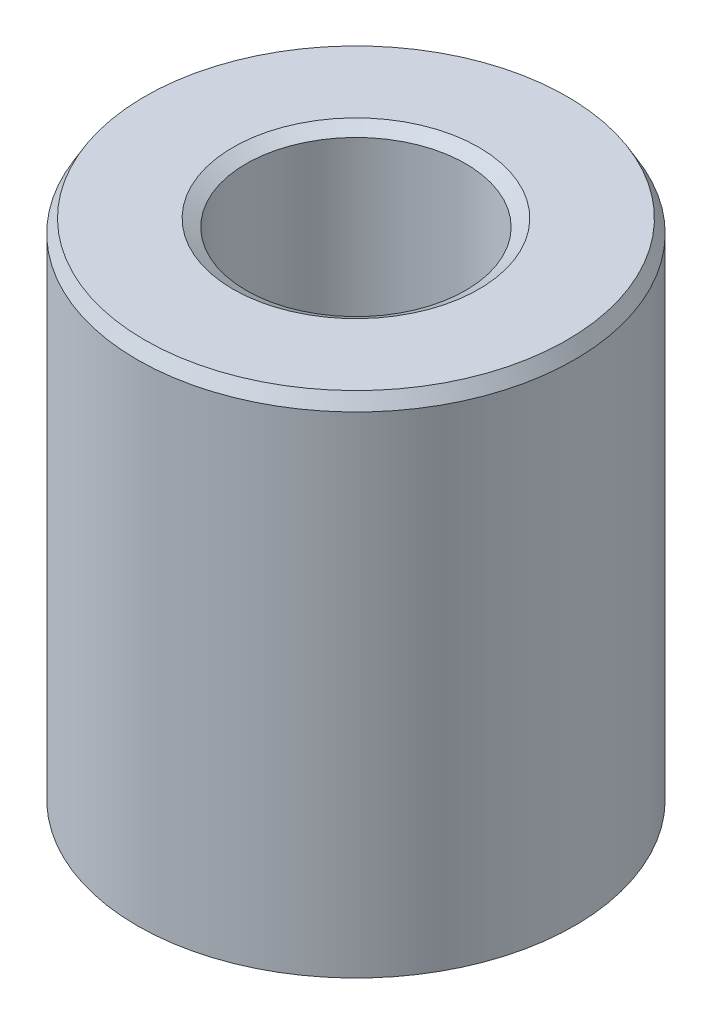
ISO-10303-21;
HEADER;
FILE_DESCRIPTION(('STEP AP214'),'2;1');
FILE_NAME('part.step','',(''),(''),'','','');
FILE_SCHEMA(('AUTOMOTIVE_DESIGN { 1 0 10303 214 1 1 1 1 }'));
ENDSEC;
DATA;
#1=APPLICATION_CONTEXT('core data for automotive mechanical design processes');
#2=APPLICATION_PROTOCOL_DEFINITION('international standard','automotive_design',2000,#1);
#3=PRODUCT_CONTEXT('',#1,'mechanical');
#4=PRODUCT('Part','Part','',(#3));
#5=PRODUCT_RELATED_PRODUCT_CATEGORY('part','',(#4));
#6=PRODUCT_DEFINITION_FORMATION('','',#4);
#7=PRODUCT_DEFINITION_CONTEXT('part definition',#1,'design');
#8=PRODUCT_DEFINITION('design','',#6,#7);
#9=PRODUCT_DEFINITION_SHAPE('','',#8);
#10=(LENGTH_UNIT() NAMED_UNIT(*) SI_UNIT(.MILLI.,.METRE.));
#11=(NAMED_UNIT(*) PLANE_ANGLE_UNIT() SI_UNIT($,.RADIAN.));
#12=(NAMED_UNIT(*) SI_UNIT($,.STERADIAN.) SOLID_ANGLE_UNIT());
#13=UNCERTAINTY_MEASURE_WITH_UNIT(LENGTH_MEASURE(1.E-05),#10,'distance_accuracy_value','');
#14=(GEOMETRIC_REPRESENTATION_CONTEXT(3) GLOBAL_UNCERTAINTY_ASSIGNED_CONTEXT((#13)) GLOBAL_UNIT_ASSIGNED_CONTEXT((#10,
#11,#12)) REPRESENTATION_CONTEXT('',''));
#15=CARTESIAN_POINT('',(0.,0.,0.));
#16=DIRECTION('',(0.,0.,1.));
#17=DIRECTION('',(1.,0.,0.));
#18=AXIS2_PLACEMENT_3D('',#15,#16,#17);
#19=CARTESIAN_POINT('',(0.,105.158621995185,0.));
#20=DIRECTION('',(0.,-1.,0.));
#21=DIRECTION('',(0.,0.,-1.));
#22=AXIS2_PLACEMENT_3D('',#19,#20,#21);
#23=CYLINDRICAL_SURFACE('',#22,45.);
#24=CARTESIAN_POINT('',(0.,1.56636908599792,0.));
#25=DIRECTION('',(0.,1.,0.));
#26=DIRECTION('',(0.,0.,1.));
#27=AXIS2_PLACEMENT_3D('',#24,#25,#26);
#28=CIRCLE('',#27,45.);
#29=CARTESIAN_POINT('',(0.,1.56636908599792,45.));
#30=VERTEX_POINT('',#29);
#31=EDGE_CURVE('E10',#30,#30,#28,.T.);
#32=ORIENTED_EDGE('',*,*,#31,.T.);
#33=EDGE_LOOP('',(#32));
#34=FACE_BOUND('',#33,.T.);
#35=CARTESIAN_POINT('',(0.,102.445591154832,0.));
#36=DIRECTION('',(0.,1.,0.));
#37=DIRECTION('',(0.,0.,1.));
#38=AXIS2_PLACEMENT_3D('',#35,#36,#37);
#39=CIRCLE('',#38,45.);
#40=CARTESIAN_POINT('',(0.,102.445591154832,45.));
#41=VERTEX_POINT('',#40);
#42=EDGE_CURVE('E50',#41,#41,#39,.F.);
#43=ORIENTED_EDGE('',*,*,#42,.T.);
#44=EDGE_LOOP('',(#43));
#45=FACE_BOUND('',#44,.T.);
#46=ADVANCED_FACE('F39',(#34,#45),#23,.T.);
#47=CARTESIAN_POINT('',(0.,105.158621995185,0.));
#48=DIRECTION('',(0.,1.,0.));
#49=DIRECTION('',(0.,0.,1.));
#50=AXIS2_PLACEMENT_3D('',#47,#48,#49);
#51=PLANE('',#50);
#52=CARTESIAN_POINT('',(0.,105.158621995185,0.));
#53=DIRECTION('',(0.,1.,0.));
#54=DIRECTION('',(0.,0.,1.));
#55=AXIS2_PLACEMENT_3D('',#52,#53,#54);
#56=CIRCLE('',#55,25.3015592322907);
#57=CARTESIAN_POINT('',(0.,105.158621995185,25.3015592322907));
#58=VERTEX_POINT('',#57);
#59=EDGE_CURVE('E58',#58,#58,#56,.F.);
#60=ORIENTED_EDGE('',*,*,#59,.T.);
#61=EDGE_LOOP('',(#60));
#62=FACE_BOUND('',#61,.T.);
#63=CARTESIAN_POINT('',(0.,105.158621995185,0.));
#64=DIRECTION('',(0.,1.,0.));
#65=DIRECTION('',(0.,0.,1.));
#66=AXIS2_PLACEMENT_3D('',#63,#64,#65);
#67=CIRCLE('',#66,43.4336309140022);
#68=CARTESIAN_POINT('',(0.,105.158621995185,43.4336309140022));
#69=VERTEX_POINT('',#68);
#70=EDGE_CURVE('E61',#69,#69,#67,.T.);
#71=ORIENTED_EDGE('',*,*,#70,.T.);
#72=EDGE_LOOP('',(#71));
#73=FACE_BOUND('',#72,.T.);
#74=ADVANCED_FACE('F88',(#62,#73),#51,.T.);
#75=CARTESIAN_POINT('',(0.,0.,0.));
#76=DIRECTION('',(0.,1.,0.));
#77=DIRECTION('',(0.,0.,1.));
#78=AXIS2_PLACEMENT_3D('',#75,#76,#77);
#79=PLANE('',#78);
#80=CARTESIAN_POINT('',(0.,0.,0.));
#81=DIRECTION('',(0.,1.,0.));
#82=DIRECTION('',(0.,0.,1.));
#83=AXIS2_PLACEMENT_3D('',#80,#81,#82);
#84=CIRCLE('',#83,24.154897477935);
#85=CARTESIAN_POINT('',(0.,0.,24.154897477935));
#86=VERTEX_POINT('',#85);
#87=EDGE_CURVE('E51',#86,#86,#84,.T.);
#88=ORIENTED_EDGE('',*,*,#87,.T.);
#89=EDGE_LOOP('',(#88));
#90=FACE_BOUND('',#89,.T.);
#91=CARTESIAN_POINT('',(0.,0.,0.));
#92=DIRECTION('',(0.,1.,0.));
#93=DIRECTION('',(0.,0.,1.));
#94=AXIS2_PLACEMENT_3D('',#91,#92,#93);
#95=CIRCLE('',#94,42.2869691596464);
#96=CARTESIAN_POINT('',(0.,0.,42.2869691596464));
#97=VERTEX_POINT('',#96);
#98=EDGE_CURVE('E54',#97,#97,#95,.F.);
#99=ORIENTED_EDGE('',*,*,#98,.T.);
#100=EDGE_LOOP('',(#99));
#101=FACE_BOUND('',#100,.T.);
#102=ADVANCED_FACE('F83',(#90,#101),#79,.F.);
#103=CARTESIAN_POINT('',(0.,105.158621995185,0.));
#104=DIRECTION('',(0.,-1.,0.));
#105=DIRECTION('',(0.,0.,-1.));
#106=AXIS2_PLACEMENT_3D('',#103,#104,#105);
#107=CYLINDRICAL_SURFACE('',#106,22.5885283919371);
#108=CARTESIAN_POINT('',(0.,103.592252909188,0.));
#109=DIRECTION('',(0.,1.,0.));
#110=DIRECTION('',(0.,0.,1.));
#111=AXIS2_PLACEMENT_3D('',#108,#109,#110);
#112=CIRCLE('',#111,22.5885283919371);
#113=CARTESIAN_POINT('',(0.,103.592252909188,22.5885283919371));
#114=VERTEX_POINT('',#113);
#115=EDGE_CURVE('E67',#114,#114,#112,.T.);
#116=ORIENTED_EDGE('',*,*,#115,.T.);
#117=EDGE_LOOP('',(#116));
#118=FACE_BOUND('',#117,.T.);
#119=CARTESIAN_POINT('',(0.,2.71303084035361,0.));
#120=DIRECTION('',(0.,1.,0.));
#121=DIRECTION('',(0.,0.,1.));
#122=AXIS2_PLACEMENT_3D('',#119,#120,#121);
#123=CIRCLE('',#122,22.5885283919371);
#124=CARTESIAN_POINT('',(0.,2.71303084035361,22.5885283919371));
#125=VERTEX_POINT('',#124);
#126=EDGE_CURVE('E69',#125,#125,#123,.F.);
#127=ORIENTED_EDGE('',*,*,#126,.T.);
#128=EDGE_LOOP('',(#127));
#129=FACE_BOUND('',#128,.T.);
#130=ADVANCED_FACE('F71',(#118,#129),#107,.F.);
#131=CARTESIAN_POINT('',(0.,103.592252909188,0.));
#132=DIRECTION('',(0.,1.,0.));
#133=DIRECTION('',(0.,0.,1.));
#134=AXIS2_PLACEMENT_3D('',#131,#132,#133);
#135=CONICAL_SURFACE('',#134,22.5885283919371,1.04719755119661);
#136=ORIENTED_EDGE('',*,*,#59,.F.);
#137=EDGE_LOOP('',(#136));
#138=FACE_BOUND('',#137,.T.);
#139=ORIENTED_EDGE('',*,*,#115,.F.);
#140=EDGE_LOOP('',(#139));
#141=FACE_BOUND('',#140,.T.);
#142=ADVANCED_FACE('F77',(#138,#141),#135,.F.);
#143=CARTESIAN_POINT('',(0.,0.,0.));
#144=DIRECTION('',(0.,-1.,0.));
#145=DIRECTION('',(0.,0.,-1.));
#146=AXIS2_PLACEMENT_3D('',#143,#144,#145);
#147=CONICAL_SURFACE('',#146,24.154897477935,0.523598775598295);
#148=ORIENTED_EDGE('',*,*,#126,.F.);
#149=EDGE_LOOP('',(#148));
#150=FACE_BOUND('',#149,.T.);
#151=ORIENTED_EDGE('',*,*,#87,.F.);
#152=EDGE_LOOP('',(#151));
#153=FACE_BOUND('',#152,.T.);
#154=ADVANCED_FACE('F73',(#150,#153),#147,.F.);
#155=CARTESIAN_POINT('',(0.,1.56636908599792,0.));
#156=DIRECTION('',(0.,1.,0.));
#157=DIRECTION('',(0.,0.,1.));
#158=AXIS2_PLACEMENT_3D('',#155,#156,#157);
#159=CONICAL_SURFACE('',#158,45.,1.0471975511966);
#160=ORIENTED_EDGE('',*,*,#98,.F.);
#161=EDGE_LOOP('',(#160));
#162=FACE_BOUND('',#161,.T.);
#163=ORIENTED_EDGE('',*,*,#31,.F.);
#164=EDGE_LOOP('',(#163));
#165=FACE_BOUND('',#164,.T.);
#166=ADVANCED_FACE('F76',(#162,#165),#159,.T.);
#167=CARTESIAN_POINT('',(0.,105.158621995185,0.));
#168=DIRECTION('',(0.,-1.,0.));
#169=DIRECTION('',(0.,0.,-1.));
#170=AXIS2_PLACEMENT_3D('',#167,#168,#169);
#171=CONICAL_SURFACE('',#170,43.4336309140022,0.523598775598293);
#172=ORIENTED_EDGE('',*,*,#42,.F.);
#173=EDGE_LOOP('',(#172));
#174=FACE_BOUND('',#173,.T.);
#175=ORIENTED_EDGE('',*,*,#70,.F.);
#176=EDGE_LOOP('',(#175));
#177=FACE_BOUND('',#176,.T.);
#178=ADVANCED_FACE('F45',(#174,#177),#171,.T.);
#179=CLOSED_SHELL('',(#46,#74,#102,#130,#142,#154,#166,#178));
#180=MANIFOLD_SOLID_BREP('B2',#179);
#181=ADVANCED_BREP_SHAPE_REPRESENTATION('',(#18,#180),#14);
#182=SHAPE_DEFINITION_REPRESENTATION(#9,#181);
ENDSEC;
END-ISO-10303-21;
